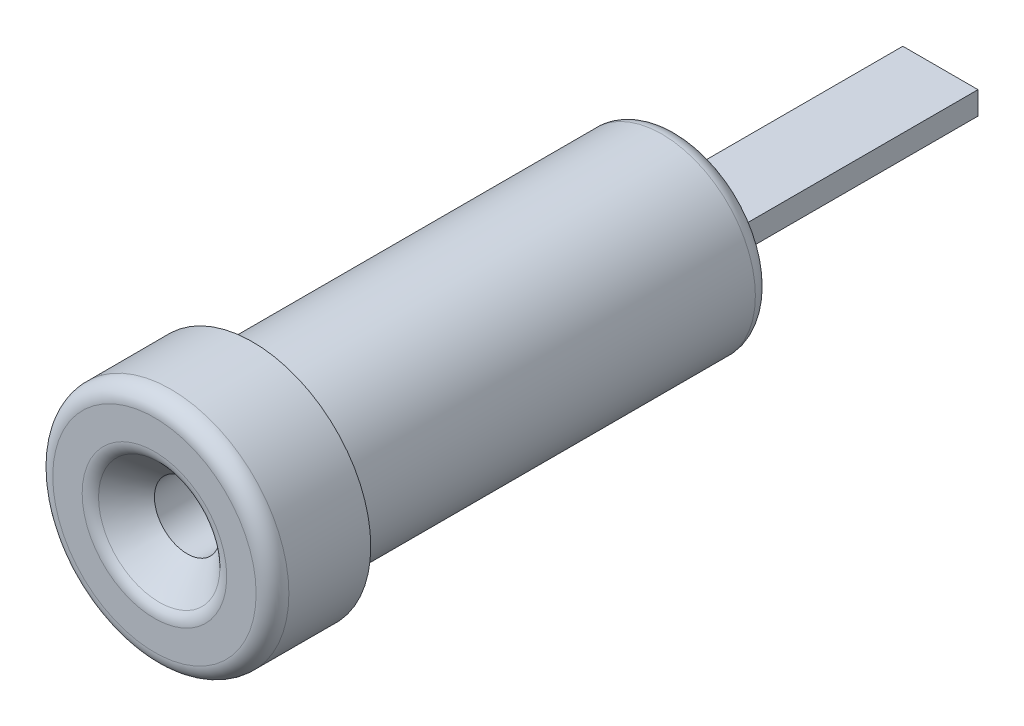
ISO-10303-21;
HEADER;
FILE_DESCRIPTION(('STEP AP214'),'2;1');
FILE_NAME('part.step','',(''),(''),'','','');
FILE_SCHEMA(('AUTOMOTIVE_DESIGN { 1 0 10303 214 1 1 1 1 }'));
ENDSEC;
DATA;
#1=APPLICATION_CONTEXT('core data for automotive mechanical design processes');
#2=APPLICATION_PROTOCOL_DEFINITION('international standard','automotive_design',2000,#1);
#3=PRODUCT_CONTEXT('',#1,'mechanical');
#4=PRODUCT('Part','Part','',(#3));
#5=PRODUCT_RELATED_PRODUCT_CATEGORY('part','',(#4));
#6=PRODUCT_DEFINITION_FORMATION('','',#4);
#7=PRODUCT_DEFINITION_CONTEXT('part definition',#1,'design');
#8=PRODUCT_DEFINITION('design','',#6,#7);
#9=PRODUCT_DEFINITION_SHAPE('','',#8);
#10=(LENGTH_UNIT() NAMED_UNIT(*) SI_UNIT(.MILLI.,.METRE.));
#11=(NAMED_UNIT(*) PLANE_ANGLE_UNIT() SI_UNIT($,.RADIAN.));
#12=(NAMED_UNIT(*) SI_UNIT($,.STERADIAN.) SOLID_ANGLE_UNIT());
#13=UNCERTAINTY_MEASURE_WITH_UNIT(LENGTH_MEASURE(1.E-05),#10,'distance_accuracy_value','');
#14=(GEOMETRIC_REPRESENTATION_CONTEXT(3) GLOBAL_UNCERTAINTY_ASSIGNED_CONTEXT((#13)) GLOBAL_UNIT_ASSIGNED_CONTEXT((#10,
#11,#12)) REPRESENTATION_CONTEXT('',''));
#15=CARTESIAN_POINT('',(0.,0.,0.));
#16=DIRECTION('',(0.,0.,1.));
#17=DIRECTION('',(1.,0.,0.));
#18=AXIS2_PLACEMENT_3D('',#15,#16,#17);
#19=CARTESIAN_POINT('',(0.,3.605,0.));
#20=DIRECTION('',(0.,0.,-1.));
#21=DIRECTION('',(-1.,0.,0.));
#22=AXIS2_PLACEMENT_3D('',#19,#20,#21);
#23=PLANE('',#22);
#24=CARTESIAN_POINT('',(0.,0.,0.));
#25=DIRECTION('',(0.,0.,-1.));
#26=DIRECTION('',(-1.,0.,0.));
#27=AXIS2_PLACEMENT_3D('',#24,#25,#26);
#28=CIRCLE('',#27,3.105);
#29=CARTESIAN_POINT('',(-3.105,0.,0.));
#30=VERTEX_POINT('',#29);
#31=EDGE_CURVE('E122',#30,#30,#28,.F.);
#32=ORIENTED_EDGE('',*,*,#31,.T.);
#33=EDGE_LOOP('',(#32));
#34=FACE_BOUND('',#33,.T.);
#35=CARTESIAN_POINT('',(0.,0.,0.));
#36=DIRECTION('',(0.,0.,-1.));
#37=DIRECTION('',(-1.,0.,0.));
#38=AXIS2_PLACEMENT_3D('',#35,#36,#37);
#39=CIRCLE('',#38,2.20710678118655);
#40=CARTESIAN_POINT('',(-2.20710678118655,0.,0.));
#41=VERTEX_POINT('',#40);
#42=EDGE_CURVE('E119',#41,#41,#39,.T.);
#43=ORIENTED_EDGE('',*,*,#42,.T.);
#44=EDGE_LOOP('',(#43));
#45=FACE_BOUND('',#44,.T.);
#46=ADVANCED_FACE('F34',(#34,#45),#23,.F.);
#47=CARTESIAN_POINT('',(0.,0.,0.));
#48=DIRECTION('',(0.,0.,1.));
#49=DIRECTION('',(1.,0.,0.));
#50=AXIS2_PLACEMENT_3D('',#47,#48,#49);
#51=CYLINDRICAL_SURFACE('',#50,1.);
#52=CARTESIAN_POINT('',(0.,0.,-1.));
#53=DIRECTION('',(0.,0.,-1.));
#54=DIRECTION('',(-1.,0.,0.));
#55=AXIS2_PLACEMENT_3D('',#52,#53,#54);
#56=CIRCLE('',#55,1.);
#57=CARTESIAN_POINT('',(-1.,0.,-1.));
#58=VERTEX_POINT('',#57);
#59=EDGE_CURVE('E116',#58,#58,#56,.F.);
#60=ORIENTED_EDGE('',*,*,#59,.T.);
#61=EDGE_LOOP('',(#60));
#62=FACE_BOUND('',#61,.T.);
#63=CARTESIAN_POINT('',(0.,0.,-12.));
#64=DIRECTION('',(0.,0.,1.));
#65=DIRECTION('',(1.,0.,0.));
#66=AXIS2_PLACEMENT_3D('',#63,#64,#65);
#67=CIRCLE('',#66,1.);
#68=CARTESIAN_POINT('',(1.,0.,-12.));
#69=VERTEX_POINT('',#68);
#70=EDGE_CURVE('E113',#69,#69,#67,.T.);
#71=ORIENTED_EDGE('',*,*,#70,.F.);
#72=EDGE_LOOP('',(#71));
#73=FACE_BOUND('',#72,.T.);
#74=ADVANCED_FACE('F146',(#62,#73),#51,.F.);
#75=CARTESIAN_POINT('',(0.,1.,-12.));
#76=DIRECTION('',(0.,0.,-1.));
#77=DIRECTION('',(-1.,0.,0.));
#78=AXIS2_PLACEMENT_3D('',#75,#76,#77);
#79=PLANE('',#78);
#80=ORIENTED_EDGE('',*,*,#70,.T.);
#81=EDGE_LOOP('',(#80));
#82=FACE_BOUND('',#81,.T.);
#83=ADVANCED_FACE('F152',(#82),#79,.F.);
#84=CARTESIAN_POINT('',(0.,1.2,-16.));
#85=DIRECTION('',(0.,0.,1.));
#86=DIRECTION('',(1.,0.,0.));
#87=AXIS2_PLACEMENT_3D('',#84,#85,#86);
#88=PLANE('',#87);
#89=CARTESIAN_POINT('',(0.,0.,-16.));
#90=DIRECTION('',(0.,0.,1.));
#91=DIRECTION('',(1.,0.,0.));
#92=AXIS2_PLACEMENT_3D('',#89,#90,#91);
#93=CIRCLE('',#92,2.35);
#94=CARTESIAN_POINT('',(2.35,0.,-16.));
#95=VERTEX_POINT('',#94);
#96=EDGE_CURVE('E11',#95,#95,#93,.F.);
#97=ORIENTED_EDGE('',*,*,#96,.T.);
#98=EDGE_LOOP('',(#97));
#99=FACE_BOUND('',#98,.T.);
#100=DIRECTION('',(0.,-1.,0.));
#101=VECTOR('',#100,1.);
#102=CARTESIAN_POINT('',(1.1478240283249,0.35,-16.));
#103=LINE('',#102,#101);
#104=CARTESIAN_POINT('',(1.1478240283249,0.35,-16.));
#105=VERTEX_POINT('',#104);
#106=CARTESIAN_POINT('',(1.1478240283249,-0.35,-16.));
#107=VERTEX_POINT('',#106);
#108=EDGE_CURVE('E88',#105,#107,#103,.T.);
#109=ORIENTED_EDGE('',*,*,#108,.F.);
#110=DIRECTION('',(1.,0.,0.));
#111=VECTOR('',#110,1.);
#112=CARTESIAN_POINT('',(1.1478240283249,0.35,-16.));
#113=LINE('',#112,#111);
#114=CARTESIAN_POINT('',(-1.1478240283249,0.35,-16.));
#115=VERTEX_POINT('',#114);
#116=EDGE_CURVE('E56',#115,#105,#113,.T.);
#117=ORIENTED_EDGE('',*,*,#116,.F.);
#118=DIRECTION('',(0.,1.,0.));
#119=VECTOR('',#118,1.);
#120=CARTESIAN_POINT('',(-1.1478240283249,0.35,-16.));
#121=LINE('',#120,#119);
#122=CARTESIAN_POINT('',(-1.1478240283249,-0.35,-16.));
#123=VERTEX_POINT('',#122);
#124=EDGE_CURVE('E85',#123,#115,#121,.T.);
#125=ORIENTED_EDGE('',*,*,#124,.F.);
#126=DIRECTION('',(-1.,0.,0.));
#127=VECTOR('',#126,1.);
#128=CARTESIAN_POINT('',(1.1478240283249,-0.35,-16.));
#129=LINE('',#128,#127);
#130=EDGE_CURVE('E93',#107,#123,#129,.T.);
#131=ORIENTED_EDGE('',*,*,#130,.F.);
#132=EDGE_LOOP('',(#109,#117,#125,#131));
#133=FACE_BOUND('',#132,.T.);
#134=ADVANCED_FACE('F84',(#99,#133),#88,.F.);
#135=CARTESIAN_POINT('',(0.,0.,0.));
#136=DIRECTION('',(0.,0.,1.));
#137=DIRECTION('',(1.,0.,0.));
#138=AXIS2_PLACEMENT_3D('',#135,#136,#137);
#139=CYLINDRICAL_SURFACE('',#138,2.85);
#140=CARTESIAN_POINT('',(0.,0.,-15.5));
#141=DIRECTION('',(0.,0.,1.));
#142=DIRECTION('',(1.,0.,0.));
#143=AXIS2_PLACEMENT_3D('',#140,#141,#142);
#144=CIRCLE('',#143,2.85);
#145=CARTESIAN_POINT('',(2.85,0.,-15.5));
#146=VERTEX_POINT('',#145);
#147=EDGE_CURVE('E42',#146,#146,#144,.T.);
#148=ORIENTED_EDGE('',*,*,#147,.T.);
#149=EDGE_LOOP('',(#148));
#150=FACE_BOUND('',#149,.T.);
#151=CARTESIAN_POINT('',(0.,0.,-3.));
#152=DIRECTION('',(0.,0.,1.));
#153=DIRECTION('',(1.,0.,0.));
#154=AXIS2_PLACEMENT_3D('',#151,#152,#153);
#155=CIRCLE('',#154,2.85);
#156=CARTESIAN_POINT('',(2.85,0.,-3.));
#157=VERTEX_POINT('',#156);
#158=EDGE_CURVE('E110',#157,#157,#155,.T.);
#159=ORIENTED_EDGE('',*,*,#158,.F.);
#160=EDGE_LOOP('',(#159));
#161=FACE_BOUND('',#160,.T.);
#162=ADVANCED_FACE('F133',(#150,#161),#139,.T.);
#163=CARTESIAN_POINT('',(0.,2.85,-3.));
#164=DIRECTION('',(0.,0.,1.));
#165=DIRECTION('',(1.,0.,0.));
#166=AXIS2_PLACEMENT_3D('',#163,#164,#165);
#167=PLANE('',#166);
#168=CARTESIAN_POINT('',(0.,0.,-3.));
#169=DIRECTION('',(0.,0.,1.));
#170=DIRECTION('',(1.,0.,0.));
#171=AXIS2_PLACEMENT_3D('',#168,#169,#170);
#172=CIRCLE('',#171,3.605);
#173=CARTESIAN_POINT('',(3.605,0.,-3.));
#174=VERTEX_POINT('',#173);
#175=EDGE_CURVE('E100',#174,#174,#172,.T.);
#176=ORIENTED_EDGE('',*,*,#175,.F.);
#177=EDGE_LOOP('',(#176));
#178=FACE_BOUND('',#177,.T.);
#179=ORIENTED_EDGE('',*,*,#158,.T.);
#180=EDGE_LOOP('',(#179));
#181=FACE_BOUND('',#180,.T.);
#182=ADVANCED_FACE('F174',(#178,#181),#167,.F.);
#183=CARTESIAN_POINT('',(0.,0.,0.));
#184=DIRECTION('',(0.,0.,1.));
#185=DIRECTION('',(1.,0.,0.));
#186=AXIS2_PLACEMENT_3D('',#183,#184,#185);
#187=CYLINDRICAL_SURFACE('',#186,3.605);
#188=CARTESIAN_POINT('',(0.,0.,-0.5));
#189=DIRECTION('',(0.,0.,-1.));
#190=DIRECTION('',(-1.,0.,0.));
#191=AXIS2_PLACEMENT_3D('',#188,#189,#190);
#192=CIRCLE('',#191,3.605);
#193=CARTESIAN_POINT('',(-3.605,0.,-0.5));
#194=VERTEX_POINT('',#193);
#195=EDGE_CURVE('E125',#194,#194,#192,.T.);
#196=ORIENTED_EDGE('',*,*,#195,.T.);
#197=EDGE_LOOP('',(#196));
#198=FACE_BOUND('',#197,.T.);
#199=ORIENTED_EDGE('',*,*,#175,.T.);
#200=EDGE_LOOP('',(#199));
#201=FACE_BOUND('',#200,.T.);
#202=ADVANCED_FACE('F171',(#198,#201),#187,.T.);
#203=CARTESIAN_POINT('',(-1.1478240283249,0.35,-10.3));
#204=DIRECTION('',(-1.,0.,0.));
#205=DIRECTION('',(0.,0.,1.));
#206=AXIS2_PLACEMENT_3D('',#203,#204,#205);
#207=PLANE('',#206);
#208=ORIENTED_EDGE('',*,*,#124,.T.);
#209=DIRECTION('',(0.,0.,-1.));
#210=VECTOR('',#209,1.);
#211=CARTESIAN_POINT('',(-1.1478240283249,0.35,-10.3));
#212=LINE('',#211,#210);
#213=CARTESIAN_POINT('',(-1.1478240283249,0.35,-24.));
#214=VERTEX_POINT('',#213);
#215=EDGE_CURVE('E74',#115,#214,#212,.T.);
#216=ORIENTED_EDGE('',*,*,#215,.T.);
#217=DIRECTION('',(0.,1.,0.));
#218=VECTOR('',#217,1.);
#219=CARTESIAN_POINT('',(-1.1478240283249,0.35,-24.));
#220=LINE('',#219,#218);
#221=CARTESIAN_POINT('',(-1.1478240283249,-0.35,-24.));
#222=VERTEX_POINT('',#221);
#223=EDGE_CURVE('E97',#222,#214,#220,.T.);
#224=ORIENTED_EDGE('',*,*,#223,.F.);
#225=DIRECTION('',(0.,0.,-1.));
#226=VECTOR('',#225,1.);
#227=CARTESIAN_POINT('',(-1.1478240283249,-0.35,-10.3));
#228=LINE('',#227,#226);
#229=EDGE_CURVE('E91',#123,#222,#228,.T.);
#230=ORIENTED_EDGE('',*,*,#229,.F.);
#231=EDGE_LOOP('',(#208,#216,#224,#230));
#232=FACE_BOUND('',#231,.T.);
#233=ADVANCED_FACE('F90',(#232),#207,.T.);
#234=CARTESIAN_POINT('',(1.1478240283249,-0.35,-10.3));
#235=DIRECTION('',(0.,-1.,0.));
#236=DIRECTION('',(0.,0.,-1.));
#237=AXIS2_PLACEMENT_3D('',#234,#235,#236);
#238=PLANE('',#237);
#239=ORIENTED_EDGE('',*,*,#130,.T.);
#240=ORIENTED_EDGE('',*,*,#229,.T.);
#241=DIRECTION('',(-1.,0.,0.));
#242=VECTOR('',#241,1.);
#243=CARTESIAN_POINT('',(1.1478240283249,-0.35,-24.));
#244=LINE('',#243,#242);
#245=CARTESIAN_POINT('',(1.1478240283249,-0.35,-24.));
#246=VERTEX_POINT('',#245);
#247=EDGE_CURVE('E105',#246,#222,#244,.T.);
#248=ORIENTED_EDGE('',*,*,#247,.F.);
#249=DIRECTION('',(0.,0.,-1.));
#250=VECTOR('',#249,1.);
#251=CARTESIAN_POINT('',(1.1478240283249,-0.35,-10.3));
#252=LINE('',#251,#250);
#253=EDGE_CURVE('E103',#107,#246,#252,.T.);
#254=ORIENTED_EDGE('',*,*,#253,.F.);
#255=EDGE_LOOP('',(#239,#240,#248,#254));
#256=FACE_BOUND('',#255,.T.);
#257=ADVANCED_FACE('F260',(#256),#238,.T.);
#258=CARTESIAN_POINT('',(1.1478240283249,0.35,-10.3));
#259=DIRECTION('',(1.,0.,0.));
#260=DIRECTION('',(0.,0.,-1.));
#261=AXIS2_PLACEMENT_3D('',#258,#259,#260);
#262=PLANE('',#261);
#263=ORIENTED_EDGE('',*,*,#108,.T.);
#264=ORIENTED_EDGE('',*,*,#253,.T.);
#265=DIRECTION('',(0.,-1.,0.));
#266=VECTOR('',#265,1.);
#267=CARTESIAN_POINT('',(1.1478240283249,0.35,-24.));
#268=LINE('',#267,#266);
#269=CARTESIAN_POINT('',(1.1478240283249,0.349999999999998,-24.));
#270=VERTEX_POINT('',#269);
#271=EDGE_CURVE('E49',#270,#246,#268,.T.);
#272=ORIENTED_EDGE('',*,*,#271,.F.);
#273=DIRECTION('',(0.,0.,-1.));
#274=VECTOR('',#273,1.);
#275=CARTESIAN_POINT('',(1.1478240283249,0.35,-10.3));
#276=LINE('',#275,#274);
#277=EDGE_CURVE('E106',#105,#270,#276,.T.);
#278=ORIENTED_EDGE('',*,*,#277,.F.);
#279=EDGE_LOOP('',(#263,#264,#272,#278));
#280=FACE_BOUND('',#279,.T.);
#281=ADVANCED_FACE('F254',(#280),#262,.T.);
#282=CARTESIAN_POINT('',(1.1478240283249,0.35,-10.3));
#283=DIRECTION('',(0.,1.,0.));
#284=DIRECTION('',(0.,0.,1.));
#285=AXIS2_PLACEMENT_3D('',#282,#283,#284);
#286=PLANE('',#285);
#287=ORIENTED_EDGE('',*,*,#116,.T.);
#288=ORIENTED_EDGE('',*,*,#277,.T.);
#289=DIRECTION('',(1.,0.,0.));
#290=VECTOR('',#289,1.);
#291=CARTESIAN_POINT('',(1.1478240283249,0.35,-24.));
#292=LINE('',#291,#290);
#293=EDGE_CURVE('E77',#214,#270,#292,.T.);
#294=ORIENTED_EDGE('',*,*,#293,.F.);
#295=ORIENTED_EDGE('',*,*,#215,.F.);
#296=EDGE_LOOP('',(#287,#288,#294,#295));
#297=FACE_BOUND('',#296,.T.);
#298=ADVANCED_FACE('F75',(#297),#286,.T.);
#299=CARTESIAN_POINT('',(0.,0.,-24.));
#300=DIRECTION('',(0.,0.,1.));
#301=DIRECTION('',(1.,0.,0.));
#302=AXIS2_PLACEMENT_3D('',#299,#300,#301);
#303=PLANE('',#302);
#304=ORIENTED_EDGE('',*,*,#223,.T.);
#305=ORIENTED_EDGE('',*,*,#293,.T.);
#306=ORIENTED_EDGE('',*,*,#271,.T.);
#307=ORIENTED_EDGE('',*,*,#247,.T.);
#308=EDGE_LOOP('',(#304,#305,#306,#307));
#309=FACE_BOUND('',#308,.T.);
#310=ADVANCED_FACE('F161',(#309),#303,.F.);
#311=CARTESIAN_POINT('',(0.,0.,-1.));
#312=DIRECTION('',(0.,0.,1.));
#313=DIRECTION('',(1.,0.,0.));
#314=AXIS2_PLACEMENT_3D('',#311,#312,#313);
#315=CONICAL_SURFACE('',#314,1.,0.78539816339745);
#316=CARTESIAN_POINT('',(0.,0.,-0.146446609406726));
#317=DIRECTION('',(0.,0.,1.));
#318=DIRECTION('',(1.,0.,0.));
#319=AXIS2_PLACEMENT_3D('',#316,#317,#318);
#320=CIRCLE('',#319,1.85355339059328);
#321=CARTESIAN_POINT('',(1.85355339059328,0.,-0.146446609406726));
#322=VERTEX_POINT('',#321);
#323=EDGE_CURVE('E128',#322,#322,#320,.T.);
#324=ORIENTED_EDGE('',*,*,#323,.T.);
#325=EDGE_LOOP('',(#324));
#326=FACE_BOUND('',#325,.T.);
#327=ORIENTED_EDGE('',*,*,#59,.F.);
#328=EDGE_LOOP('',(#327));
#329=FACE_BOUND('',#328,.T.);
#330=ADVANCED_FACE('F158',(#326,#329),#315,.F.);
#331=CARTESIAN_POINT('',(0.,0.,-0.5));
#332=DIRECTION('',(0.,0.,-1.));
#333=DIRECTION('',(-1.,0.,0.));
#334=AXIS2_PLACEMENT_3D('',#331,#332,#333);
#335=TOROIDAL_SURFACE('',#334,3.105,0.5);
#336=ORIENTED_EDGE('',*,*,#195,.F.);
#337=EDGE_LOOP('',(#336));
#338=FACE_BOUND('',#337,.T.);
#339=ORIENTED_EDGE('',*,*,#31,.F.);
#340=EDGE_LOOP('',(#339));
#341=FACE_BOUND('',#340,.T.);
#342=ADVANCED_FACE('F142',(#338,#341),#335,.T.);
#343=CARTESIAN_POINT('',(0.,0.,-0.5));
#344=DIRECTION('',(0.,0.,-1.));
#345=DIRECTION('',(-1.,0.,0.));
#346=AXIS2_PLACEMENT_3D('',#343,#344,#345);
#347=TOROIDAL_SURFACE('',#346,2.20710678118655,0.5);
#348=ORIENTED_EDGE('',*,*,#323,.F.);
#349=EDGE_LOOP('',(#348));
#350=FACE_BOUND('',#349,.T.);
#351=ORIENTED_EDGE('',*,*,#42,.F.);
#352=EDGE_LOOP('',(#351));
#353=FACE_BOUND('',#352,.T.);
#354=ADVANCED_FACE('F137',(#350,#353),#347,.T.);
#355=CARTESIAN_POINT('',(0.,0.,-15.5));
#356=DIRECTION('',(0.,0.,1.));
#357=DIRECTION('',(1.,0.,0.));
#358=AXIS2_PLACEMENT_3D('',#355,#356,#357);
#359=TOROIDAL_SURFACE('',#358,2.35,0.5);
#360=ORIENTED_EDGE('',*,*,#96,.F.);
#361=EDGE_LOOP('',(#360));
#362=FACE_BOUND('',#361,.T.);
#363=ORIENTED_EDGE('',*,*,#147,.F.);
#364=EDGE_LOOP('',(#363));
#365=FACE_BOUND('',#364,.T.);
#366=ADVANCED_FACE('F36',(#362,#365),#359,.T.);
#367=CLOSED_SHELL('',(#46,#74,#83,#134,#162,#182,#202,#233,#257,#281,#298,#310,#330,#342,#354,#366));
#368=MANIFOLD_SOLID_BREP('B2',#367);
#369=ADVANCED_BREP_SHAPE_REPRESENTATION('',(#18,#368),#14);
#370=SHAPE_DEFINITION_REPRESENTATION(#9,#369);
ENDSEC;
END-ISO-10303-21;
